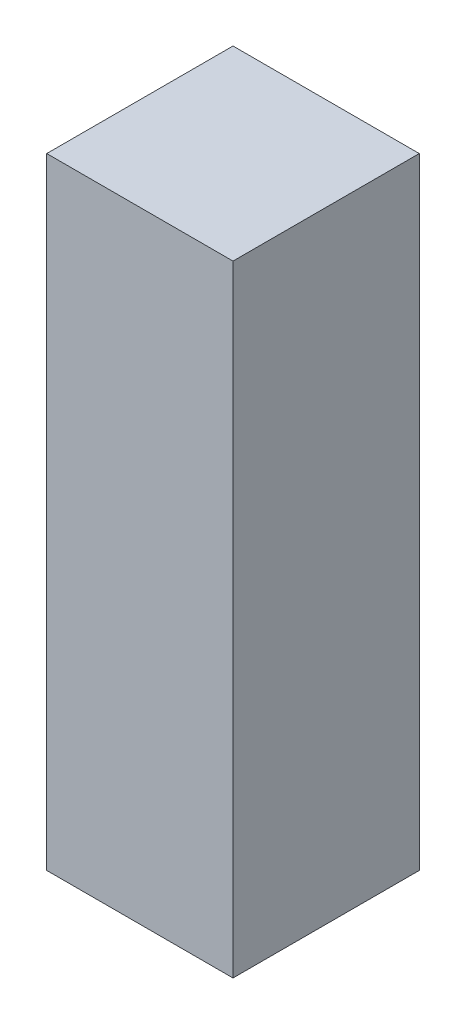
ISO-10303-21;
HEADER;
FILE_DESCRIPTION(('STEP AP214'),'2;1');
FILE_NAME('part.step','',(''),(''),'','','');
FILE_SCHEMA(('AUTOMOTIVE_DESIGN { 1 0 10303 214 1 1 1 1 }'));
ENDSEC;
DATA;
#1=APPLICATION_CONTEXT('core data for automotive mechanical design processes');
#2=APPLICATION_PROTOCOL_DEFINITION('international standard','automotive_design',2000,#1);
#3=PRODUCT_CONTEXT('',#1,'mechanical');
#4=PRODUCT('Part','Part','',(#3));
#5=PRODUCT_RELATED_PRODUCT_CATEGORY('part','',(#4));
#6=PRODUCT_DEFINITION_FORMATION('','',#4);
#7=PRODUCT_DEFINITION_CONTEXT('part definition',#1,'design');
#8=PRODUCT_DEFINITION('design','',#6,#7);
#9=PRODUCT_DEFINITION_SHAPE('','',#8);
#10=(LENGTH_UNIT() NAMED_UNIT(*) SI_UNIT(.MILLI.,.METRE.));
#11=(NAMED_UNIT(*) PLANE_ANGLE_UNIT() SI_UNIT($,.RADIAN.));
#12=(NAMED_UNIT(*) SI_UNIT($,.STERADIAN.) SOLID_ANGLE_UNIT());
#13=UNCERTAINTY_MEASURE_WITH_UNIT(LENGTH_MEASURE(1.E-05),#10,'distance_accuracy_value','');
#14=(GEOMETRIC_REPRESENTATION_CONTEXT(3) GLOBAL_UNCERTAINTY_ASSIGNED_CONTEXT((#13)) GLOBAL_UNIT_ASSIGNED_CONTEXT((#10,
#11,#12)) REPRESENTATION_CONTEXT('',''));
#15=CARTESIAN_POINT('',(0.,0.,0.));
#16=DIRECTION('',(0.,0.,1.));
#17=DIRECTION('',(1.,0.,0.));
#18=AXIS2_PLACEMENT_3D('',#15,#16,#17);
#19=CARTESIAN_POINT('',(-29.2100000000001,303.941713853571,99.06));
#20=DIRECTION('',(1.,0.,0.));
#21=DIRECTION('',(0.,1.,0.));
#22=AXIS2_PLACEMENT_3D('',#19,#20,#21);
#23=PLANE('',#22);
#24=DIRECTION('',(0.,-1.,0.));
#25=VECTOR('',#24,1.);
#26=CARTESIAN_POINT('',(-29.2100000000001,303.941713853571,0.));
#27=LINE('',#26,#25);
#28=CARTESIAN_POINT('',(-29.2100000000001,303.941713853571,0.));
#29=VERTEX_POINT('',#28);
#30=CARTESIAN_POINT('',(-29.21,-26.2582861464288,0.));
#31=VERTEX_POINT('',#30);
#32=EDGE_CURVE('E72',#29,#31,#27,.T.);
#33=ORIENTED_EDGE('',*,*,#32,.T.);
#34=DIRECTION('',(0.,0.,-1.));
#35=VECTOR('',#34,1.);
#36=CARTESIAN_POINT('',(-29.21,-26.2582861464288,99.06));
#37=LINE('',#36,#35);
#38=CARTESIAN_POINT('',(-29.21,-26.2582861464288,99.06));
#39=VERTEX_POINT('',#38);
#40=EDGE_CURVE('E11',#39,#31,#37,.T.);
#41=ORIENTED_EDGE('',*,*,#40,.F.);
#42=DIRECTION('',(0.,-1.,0.));
#43=VECTOR('',#42,1.);
#44=CARTESIAN_POINT('',(-29.2100000000001,303.941713853571,99.06));
#45=LINE('',#44,#43);
#46=CARTESIAN_POINT('',(-29.2100000000001,303.941713853571,99.06));
#47=VERTEX_POINT('',#46);
#48=EDGE_CURVE('E66',#47,#39,#45,.T.);
#49=ORIENTED_EDGE('',*,*,#48,.F.);
#50=DIRECTION('',(0.,0.,-1.));
#51=VECTOR('',#50,1.);
#52=CARTESIAN_POINT('',(-29.2100000000001,303.941713853571,99.06));
#53=LINE('',#52,#51);
#54=EDGE_CURVE('E19',#47,#29,#53,.T.);
#55=ORIENTED_EDGE('',*,*,#54,.T.);
#56=EDGE_LOOP('',(#33,#41,#49,#55));
#57=FACE_BOUND('',#56,.T.);
#58=ADVANCED_FACE('F16',(#57),#23,.F.);
#59=CARTESIAN_POINT('',(-29.21,-26.2582861464288,99.06));
#60=DIRECTION('',(0.,1.,0.));
#61=DIRECTION('',(-1.,0.,0.));
#62=AXIS2_PLACEMENT_3D('',#59,#60,#61);
#63=PLANE('',#62);
#64=DIRECTION('',(1.,0.,0.));
#65=VECTOR('',#64,1.);
#66=CARTESIAN_POINT('',(-29.21,-26.2582861464288,0.));
#67=LINE('',#66,#65);
#68=CARTESIAN_POINT('',(69.85,-26.2582861464288,0.));
#69=VERTEX_POINT('',#68);
#70=EDGE_CURVE('E75',#31,#69,#67,.T.);
#71=ORIENTED_EDGE('',*,*,#70,.T.);
#72=DIRECTION('',(0.,0.,-1.));
#73=VECTOR('',#72,1.);
#74=CARTESIAN_POINT('',(69.85,-26.2582861464288,99.06));
#75=LINE('',#74,#73);
#76=CARTESIAN_POINT('',(69.85,-26.2582861464288,99.06));
#77=VERTEX_POINT('',#76);
#78=EDGE_CURVE('E24',#77,#69,#75,.T.);
#79=ORIENTED_EDGE('',*,*,#78,.F.);
#80=DIRECTION('',(1.,0.,0.));
#81=VECTOR('',#80,1.);
#82=CARTESIAN_POINT('',(-29.21,-26.2582861464288,99.06));
#83=LINE('',#82,#81);
#84=EDGE_CURVE('E36',#39,#77,#83,.T.);
#85=ORIENTED_EDGE('',*,*,#84,.F.);
#86=ORIENTED_EDGE('',*,*,#40,.T.);
#87=EDGE_LOOP('',(#71,#79,#85,#86));
#88=FACE_BOUND('',#87,.T.);
#89=ADVANCED_FACE('F89',(#88),#63,.F.);
#90=CARTESIAN_POINT('',(69.85,-26.2582861464288,99.06));
#91=DIRECTION('',(-1.,0.,0.));
#92=DIRECTION('',(0.,-1.,0.));
#93=AXIS2_PLACEMENT_3D('',#90,#91,#92);
#94=PLANE('',#93);
#95=DIRECTION('',(0.,1.,0.));
#96=VECTOR('',#95,1.);
#97=CARTESIAN_POINT('',(69.85,-26.2582861464288,0.));
#98=LINE('',#97,#96);
#99=CARTESIAN_POINT('',(69.8499999999999,303.941713853571,0.));
#100=VERTEX_POINT('',#99);
#101=EDGE_CURVE('E67',#69,#100,#98,.T.);
#102=ORIENTED_EDGE('',*,*,#101,.T.);
#103=DIRECTION('',(0.,0.,-1.));
#104=VECTOR('',#103,1.);
#105=CARTESIAN_POINT('',(69.8499999999999,303.941713853571,99.06));
#106=LINE('',#105,#104);
#107=CARTESIAN_POINT('',(69.8499999999999,303.941713853571,99.06));
#108=VERTEX_POINT('',#107);
#109=EDGE_CURVE('E62',#108,#100,#106,.T.);
#110=ORIENTED_EDGE('',*,*,#109,.F.);
#111=DIRECTION('',(0.,1.,0.));
#112=VECTOR('',#111,1.);
#113=CARTESIAN_POINT('',(69.85,-26.2582861464288,99.06));
#114=LINE('',#113,#112);
#115=EDGE_CURVE('E31',#77,#108,#114,.T.);
#116=ORIENTED_EDGE('',*,*,#115,.F.);
#117=ORIENTED_EDGE('',*,*,#78,.T.);
#118=EDGE_LOOP('',(#102,#110,#116,#117));
#119=FACE_BOUND('',#118,.T.);
#120=ADVANCED_FACE('F87',(#119),#94,.F.);
#121=CARTESIAN_POINT('',(69.8499999999999,303.941713853571,99.06));
#122=DIRECTION('',(0.,-1.,0.));
#123=DIRECTION('',(0.,0.,-1.));
#124=AXIS2_PLACEMENT_3D('',#121,#122,#123);
#125=PLANE('',#124);
#126=DIRECTION('',(-1.,0.,0.));
#127=VECTOR('',#126,1.);
#128=CARTESIAN_POINT('',(69.8499999999999,303.941713853571,0.));
#129=LINE('',#128,#127);
#130=EDGE_CURVE('E57',#100,#29,#129,.T.);
#131=ORIENTED_EDGE('',*,*,#130,.T.);
#132=ORIENTED_EDGE('',*,*,#54,.F.);
#133=DIRECTION('',(-1.,0.,0.));
#134=VECTOR('',#133,1.);
#135=CARTESIAN_POINT('',(69.8499999999999,303.941713853571,99.06));
#136=LINE('',#135,#134);
#137=EDGE_CURVE('E73',#108,#47,#136,.T.);
#138=ORIENTED_EDGE('',*,*,#137,.F.);
#139=ORIENTED_EDGE('',*,*,#109,.T.);
#140=EDGE_LOOP('',(#131,#132,#138,#139));
#141=FACE_BOUND('',#140,.T.);
#142=ADVANCED_FACE('F59',(#141),#125,.F.);
#143=CARTESIAN_POINT('',(-29.21,-26.2582861464288,99.06));
#144=DIRECTION('',(0.,0.,1.));
#145=DIRECTION('',(1.,0.,0.));
#146=AXIS2_PLACEMENT_3D('',#143,#144,#145);
#147=PLANE('',#146);
#148=ORIENTED_EDGE('',*,*,#48,.T.);
#149=ORIENTED_EDGE('',*,*,#84,.T.);
#150=ORIENTED_EDGE('',*,*,#115,.T.);
#151=ORIENTED_EDGE('',*,*,#137,.T.);
#152=EDGE_LOOP('',(#148,#149,#150,#151));
#153=FACE_BOUND('',#152,.T.);
#154=ADVANCED_FACE('F90',(#153),#147,.T.);
#155=CARTESIAN_POINT('',(-29.21,-26.2582861464288,0.));
#156=DIRECTION('',(0.,0.,1.));
#157=DIRECTION('',(1.,0.,0.));
#158=AXIS2_PLACEMENT_3D('',#155,#156,#157);
#159=PLANE('',#158);
#160=ORIENTED_EDGE('',*,*,#32,.F.);
#161=ORIENTED_EDGE('',*,*,#130,.F.);
#162=ORIENTED_EDGE('',*,*,#101,.F.);
#163=ORIENTED_EDGE('',*,*,#70,.F.);
#164=EDGE_LOOP('',(#160,#161,#162,#163));
#165=FACE_BOUND('',#164,.T.);
#166=ADVANCED_FACE('F74',(#165),#159,.F.);
#167=CLOSED_SHELL('',(#58,#89,#120,#142,#154,#166));
#168=MANIFOLD_SOLID_BREP('B1',#167);
#169=ADVANCED_BREP_SHAPE_REPRESENTATION('',(#18,#168),#14);
#170=SHAPE_DEFINITION_REPRESENTATION(#9,#169);
ENDSEC;
END-ISO-10303-21;
